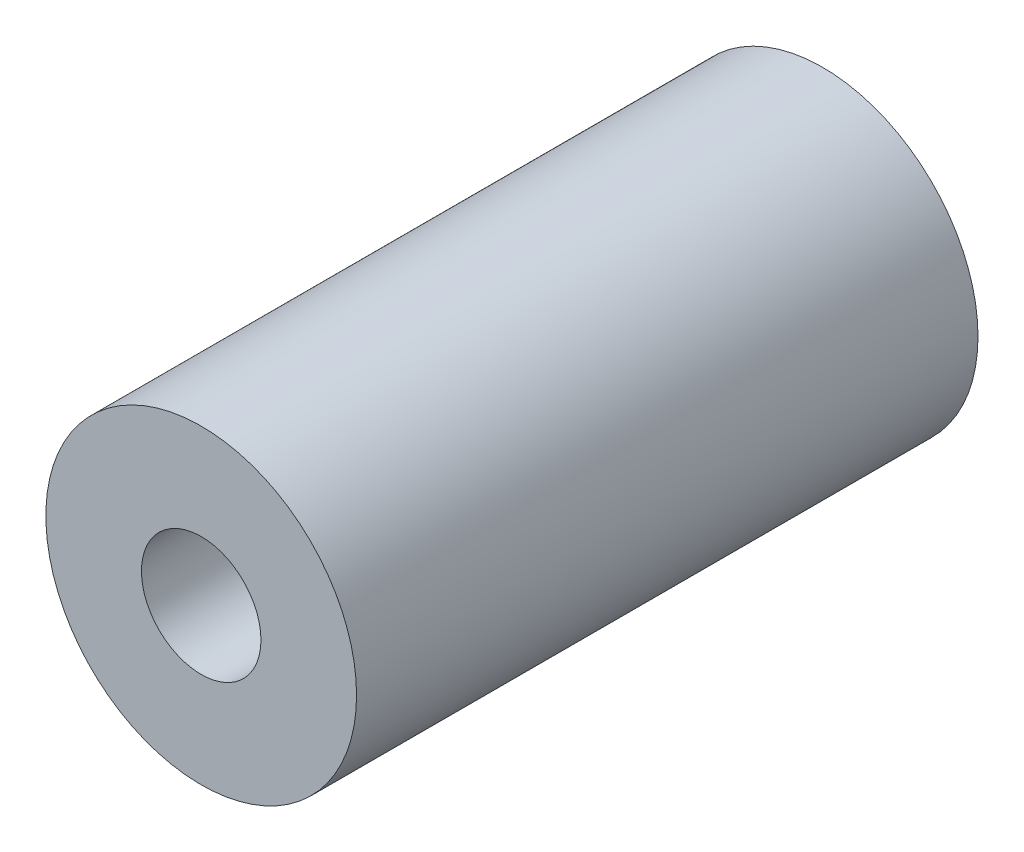
ISO-10303-21;
HEADER;
FILE_DESCRIPTION(('STEP AP214'),'2;1');
FILE_NAME('part.step','',(''),(''),'','','');
FILE_SCHEMA(('AUTOMOTIVE_DESIGN { 1 0 10303 214 1 1 1 1 }'));
ENDSEC;
DATA;
#1=APPLICATION_CONTEXT('core data for automotive mechanical design processes');
#2=APPLICATION_PROTOCOL_DEFINITION('international standard','automotive_design',2000,#1);
#3=PRODUCT_CONTEXT('',#1,'mechanical');
#4=PRODUCT('Part','Part','',(#3));
#5=PRODUCT_RELATED_PRODUCT_CATEGORY('part','',(#4));
#6=PRODUCT_DEFINITION_FORMATION('','',#4);
#7=PRODUCT_DEFINITION_CONTEXT('part definition',#1,'design');
#8=PRODUCT_DEFINITION('design','',#6,#7);
#9=PRODUCT_DEFINITION_SHAPE('','',#8);
#10=(LENGTH_UNIT() NAMED_UNIT(*) SI_UNIT(.MILLI.,.METRE.));
#11=(NAMED_UNIT(*) PLANE_ANGLE_UNIT() SI_UNIT($,.RADIAN.));
#12=(NAMED_UNIT(*) SI_UNIT($,.STERADIAN.) SOLID_ANGLE_UNIT());
#13=UNCERTAINTY_MEASURE_WITH_UNIT(LENGTH_MEASURE(1.E-05),#10,'distance_accuracy_value','');
#14=(GEOMETRIC_REPRESENTATION_CONTEXT(3) GLOBAL_UNCERTAINTY_ASSIGNED_CONTEXT((#13)) GLOBAL_UNIT_ASSIGNED_CONTEXT((#10,
#11,#12)) REPRESENTATION_CONTEXT('',''));
#15=CARTESIAN_POINT('',(0.,0.,0.));
#16=DIRECTION('',(0.,0.,1.));
#17=DIRECTION('',(1.,0.,0.));
#18=AXIS2_PLACEMENT_3D('',#15,#16,#17);
#19=CARTESIAN_POINT('',(0.,0.,13.));
#20=DIRECTION('',(0.,0.,1.));
#21=DIRECTION('',(1.,0.,0.));
#22=AXIS2_PLACEMENT_3D('',#19,#20,#21);
#23=PLANE('',#22);
#24=CARTESIAN_POINT('',(0.,0.,13.));
#25=DIRECTION('',(0.,0.,1.));
#26=DIRECTION('',(1.,0.,0.));
#27=AXIS2_PLACEMENT_3D('',#24,#25,#26);
#28=CIRCLE('',#27,3.25);
#29=CARTESIAN_POINT('',(3.25,0.,13.));
#30=VERTEX_POINT('',#29);
#31=EDGE_CURVE('E10',#30,#30,#28,.T.);
#32=ORIENTED_EDGE('',*,*,#31,.T.);
#33=EDGE_LOOP('',(#32));
#34=FACE_BOUND('',#33,.T.);
#35=CARTESIAN_POINT('',(0.,0.,13.));
#36=DIRECTION('',(0.,0.,1.));
#37=DIRECTION('',(1.,0.,0.));
#38=AXIS2_PLACEMENT_3D('',#35,#36,#37);
#39=CIRCLE('',#38,1.25);
#40=CARTESIAN_POINT('',(1.25,0.,13.));
#41=VERTEX_POINT('',#40);
#42=EDGE_CURVE('E44',#41,#41,#39,.T.);
#43=ORIENTED_EDGE('',*,*,#42,.F.);
#44=EDGE_LOOP('',(#43));
#45=FACE_BOUND('',#44,.T.);
#46=ADVANCED_FACE('F33',(#34,#45),#23,.T.);
#47=CARTESIAN_POINT('',(0.,0.,0.));
#48=DIRECTION('',(0.,0.,1.));
#49=DIRECTION('',(1.,0.,0.));
#50=AXIS2_PLACEMENT_3D('',#47,#48,#49);
#51=PLANE('',#50);
#52=CARTESIAN_POINT('',(0.,0.,0.));
#53=DIRECTION('',(0.,0.,1.));
#54=DIRECTION('',(1.,0.,0.));
#55=AXIS2_PLACEMENT_3D('',#52,#53,#54);
#56=CIRCLE('',#55,3.25);
#57=CARTESIAN_POINT('',(3.25,0.,0.));
#58=VERTEX_POINT('',#57);
#59=EDGE_CURVE('E37',#58,#58,#56,.T.);
#60=ORIENTED_EDGE('',*,*,#59,.F.);
#61=EDGE_LOOP('',(#60));
#62=FACE_BOUND('',#61,.T.);
#63=CARTESIAN_POINT('',(0.,0.,0.));
#64=DIRECTION('',(0.,0.,1.));
#65=DIRECTION('',(1.,0.,0.));
#66=AXIS2_PLACEMENT_3D('',#63,#64,#65);
#67=CIRCLE('',#66,1.25);
#68=CARTESIAN_POINT('',(1.25,0.,0.));
#69=VERTEX_POINT('',#68);
#70=EDGE_CURVE('E46',#69,#69,#67,.T.);
#71=ORIENTED_EDGE('',*,*,#70,.T.);
#72=EDGE_LOOP('',(#71));
#73=FACE_BOUND('',#72,.T.);
#74=ADVANCED_FACE('F56',(#62,#73),#51,.F.);
#75=CARTESIAN_POINT('',(0.,0.,13.));
#76=DIRECTION('',(0.,0.,-1.));
#77=DIRECTION('',(-1.,0.,0.));
#78=AXIS2_PLACEMENT_3D('',#75,#76,#77);
#79=CYLINDRICAL_SURFACE('',#78,3.25);
#80=ORIENTED_EDGE('',*,*,#31,.F.);
#81=EDGE_LOOP('',(#80));
#82=FACE_BOUND('',#81,.T.);
#83=ORIENTED_EDGE('',*,*,#59,.T.);
#84=EDGE_LOOP('',(#83));
#85=FACE_BOUND('',#84,.T.);
#86=ADVANCED_FACE('F35',(#82,#85),#79,.T.);
#87=CARTESIAN_POINT('',(0.,0.,13.));
#88=DIRECTION('',(0.,0.,-1.));
#89=DIRECTION('',(-1.,0.,0.));
#90=AXIS2_PLACEMENT_3D('',#87,#88,#89);
#91=CYLINDRICAL_SURFACE('',#90,1.25);
#92=ORIENTED_EDGE('',*,*,#42,.T.);
#93=EDGE_LOOP('',(#92));
#94=FACE_BOUND('',#93,.T.);
#95=ORIENTED_EDGE('',*,*,#70,.F.);
#96=EDGE_LOOP('',(#95));
#97=FACE_BOUND('',#96,.T.);
#98=ADVANCED_FACE('F52',(#94,#97),#91,.F.);
#99=CLOSED_SHELL('',(#46,#74,#86,#98));
#100=MANIFOLD_SOLID_BREP('B2',#99);
#101=ADVANCED_BREP_SHAPE_REPRESENTATION('',(#18,#100),#14);
#102=SHAPE_DEFINITION_REPRESENTATION(#9,#101);
ENDSEC;
END-ISO-10303-21;
